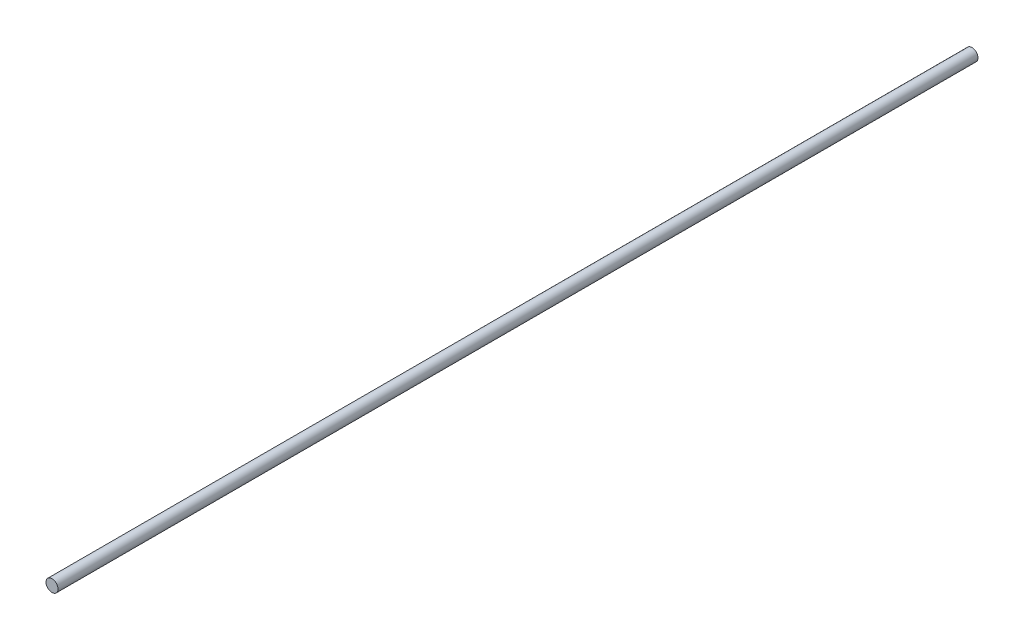
ISO-10303-21;
HEADER;
FILE_DESCRIPTION(('STEP AP214'),'2;1');
FILE_NAME('part.step','',(''),(''),'','','');
FILE_SCHEMA(('AUTOMOTIVE_DESIGN { 1 0 10303 214 1 1 1 1 }'));
ENDSEC;
DATA;
#1=APPLICATION_CONTEXT('core data for automotive mechanical design processes');
#2=APPLICATION_PROTOCOL_DEFINITION('international standard','automotive_design',2000,#1);
#3=PRODUCT_CONTEXT('',#1,'mechanical');
#4=PRODUCT('Part','Part','',(#3));
#5=PRODUCT_RELATED_PRODUCT_CATEGORY('part','',(#4));
#6=PRODUCT_DEFINITION_FORMATION('','',#4);
#7=PRODUCT_DEFINITION_CONTEXT('part definition',#1,'design');
#8=PRODUCT_DEFINITION('design','',#6,#7);
#9=PRODUCT_DEFINITION_SHAPE('','',#8);
#10=(LENGTH_UNIT() NAMED_UNIT(*) SI_UNIT(.MILLI.,.METRE.));
#11=(NAMED_UNIT(*) PLANE_ANGLE_UNIT() SI_UNIT($,.RADIAN.));
#12=(NAMED_UNIT(*) SI_UNIT($,.STERADIAN.) SOLID_ANGLE_UNIT());
#13=UNCERTAINTY_MEASURE_WITH_UNIT(LENGTH_MEASURE(1.E-05),#10,'distance_accuracy_value','');
#14=(GEOMETRIC_REPRESENTATION_CONTEXT(3) GLOBAL_UNCERTAINTY_ASSIGNED_CONTEXT((#13)) GLOBAL_UNIT_ASSIGNED_CONTEXT((#10,
#11,#12)) REPRESENTATION_CONTEXT('',''));
#15=CARTESIAN_POINT('',(0.,0.,0.));
#16=DIRECTION('',(0.,0.,1.));
#17=DIRECTION('',(1.,0.,0.));
#18=AXIS2_PLACEMENT_3D('',#15,#16,#17);
#19=CARTESIAN_POINT('',(-2.49757624329591,4.49216838203917,2000.));
#20=DIRECTION('',(0.,0.,-1.));
#21=DIRECTION('',(-1.,0.,0.));
#22=AXIS2_PLACEMENT_3D('',#19,#20,#21);
#23=CYLINDRICAL_SURFACE('',#22,13.05);
#24=CARTESIAN_POINT('',(-2.49757624329591,4.49216838203917,2000.));
#25=DIRECTION('',(0.,0.,1.));
#26=DIRECTION('',(1.,0.,0.));
#27=AXIS2_PLACEMENT_3D('',#24,#25,#26);
#28=CIRCLE('',#27,13.05);
#29=CARTESIAN_POINT('',(10.5524237567041,4.49216838203917,2000.));
#30=VERTEX_POINT('',#29);
#31=EDGE_CURVE('E10',#30,#30,#28,.T.);
#32=ORIENTED_EDGE('',*,*,#31,.F.);
#33=EDGE_LOOP('',(#32));
#34=FACE_BOUND('',#33,.T.);
#35=CARTESIAN_POINT('',(-2.49757624329591,4.49216838203917,0.));
#36=DIRECTION('',(0.,0.,1.));
#37=DIRECTION('',(1.,0.,0.));
#38=AXIS2_PLACEMENT_3D('',#35,#36,#37);
#39=CIRCLE('',#38,13.05);
#40=CARTESIAN_POINT('',(10.5524237567041,4.49216838203917,0.));
#41=VERTEX_POINT('',#40);
#42=EDGE_CURVE('E44',#41,#41,#39,.T.);
#43=ORIENTED_EDGE('',*,*,#42,.T.);
#44=EDGE_LOOP('',(#43));
#45=FACE_BOUND('',#44,.T.);
#46=ADVANCED_FACE('F41',(#34,#45),#23,.T.);
#47=CARTESIAN_POINT('',(-2.49757624329591,4.49216838203917,2000.));
#48=DIRECTION('',(0.,0.,1.));
#49=DIRECTION('',(1.,0.,0.));
#50=AXIS2_PLACEMENT_3D('',#47,#48,#49);
#51=PLANE('',#50);
#52=ORIENTED_EDGE('',*,*,#31,.T.);
#53=EDGE_LOOP('',(#52));
#54=FACE_BOUND('',#53,.T.);
#55=ADVANCED_FACE('F58',(#54),#51,.T.);
#56=CARTESIAN_POINT('',(-2.49757624329591,4.49216838203917,0.));
#57=DIRECTION('',(0.,0.,1.));
#58=DIRECTION('',(1.,0.,0.));
#59=AXIS2_PLACEMENT_3D('',#56,#57,#58);
#60=PLANE('',#59);
#61=ORIENTED_EDGE('',*,*,#42,.F.);
#62=EDGE_LOOP('',(#61));
#63=FACE_BOUND('',#62,.T.);
#64=ADVANCED_FACE('F56',(#63),#60,.F.);
#65=CLOSED_SHELL('',(#46,#55,#64));
#66=MANIFOLD_SOLID_BREP('B2',#65);
#67=ADVANCED_BREP_SHAPE_REPRESENTATION('',(#18,#66),#14);
#68=SHAPE_DEFINITION_REPRESENTATION(#9,#67);
ENDSEC;
END-ISO-10303-21;
